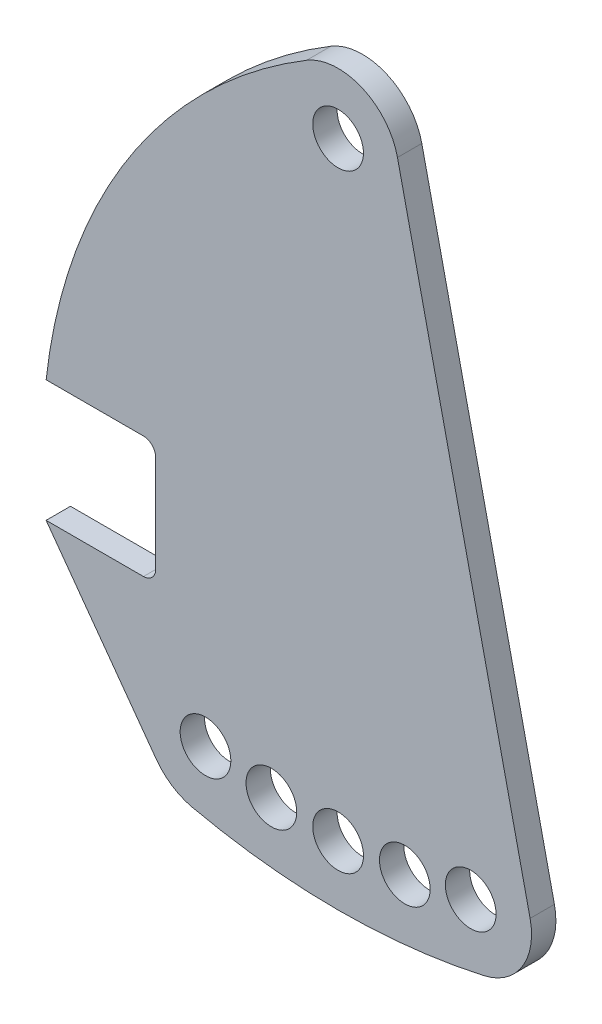
ISO-10303-21;
HEADER;
FILE_DESCRIPTION(('STEP AP214'),'2;1');
FILE_NAME('part.step','',(''),(''),'','','');
FILE_SCHEMA(('AUTOMOTIVE_DESIGN { 1 0 10303 214 1 1 1 1 }'));
ENDSEC;
DATA;
#1=APPLICATION_CONTEXT('core data for automotive mechanical design processes');
#2=APPLICATION_PROTOCOL_DEFINITION('international standard','automotive_design',2000,#1);
#3=PRODUCT_CONTEXT('',#1,'mechanical');
#4=PRODUCT('Part','Part','',(#3));
#5=PRODUCT_RELATED_PRODUCT_CATEGORY('part','',(#4));
#6=PRODUCT_DEFINITION_FORMATION('','',#4);
#7=PRODUCT_DEFINITION_CONTEXT('part definition',#1,'design');
#8=PRODUCT_DEFINITION('design','',#6,#7);
#9=PRODUCT_DEFINITION_SHAPE('','',#8);
#10=(LENGTH_UNIT() NAMED_UNIT(*) SI_UNIT(.MILLI.,.METRE.));
#11=(NAMED_UNIT(*) PLANE_ANGLE_UNIT() SI_UNIT($,.RADIAN.));
#12=(NAMED_UNIT(*) SI_UNIT($,.STERADIAN.) SOLID_ANGLE_UNIT());
#13=UNCERTAINTY_MEASURE_WITH_UNIT(LENGTH_MEASURE(1.E-05),#10,'distance_accuracy_value','');
#14=(GEOMETRIC_REPRESENTATION_CONTEXT(3) GLOBAL_UNCERTAINTY_ASSIGNED_CONTEXT((#13)) GLOBAL_UNIT_ASSIGNED_CONTEXT((#10,
#11,#12)) REPRESENTATION_CONTEXT('',''));
#15=CARTESIAN_POINT('',(0.,0.,0.));
#16=DIRECTION('',(0.,0.,1.));
#17=DIRECTION('',(1.,0.,0.));
#18=AXIS2_PLACEMENT_3D('',#15,#16,#17);
#19=CARTESIAN_POINT('',(27.2901991456274,-43.6081884559611,6.));
#20=DIRECTION('',(0.,0.,1.));
#21=DIRECTION('',(1.,0.,0.));
#22=AXIS2_PLACEMENT_3D('',#19,#20,#21);
#23=PLANE('',#22);
#24=CARTESIAN_POINT('',(76.4329181119862,-46.4218250983476,6.));
#25=DIRECTION('',(0.,0.,1.));
#26=DIRECTION('',(1.,0.,0.));
#27=AXIS2_PLACEMENT_3D('',#24,#25,#26);
#28=CIRCLE('',#27,6.25000000000003);
#29=CARTESIAN_POINT('',(82.6829181119862,-46.4218250983476,6.));
#30=VERTEX_POINT('',#29);
#31=EDGE_CURVE('E304',#30,#30,#28,.T.);
#32=ORIENTED_EDGE('',*,*,#31,.F.);
#33=EDGE_LOOP('',(#32));
#34=FACE_BOUND('',#33,.T.);
#35=CARTESIAN_POINT('',(43.5333777049843,-46.4218250983477,6.));
#36=DIRECTION('',(0.,0.,1.));
#37=DIRECTION('',(1.,0.,0.));
#38=AXIS2_PLACEMENT_3D('',#35,#36,#37);
#39=CIRCLE('',#38,6.25000000000003);
#40=CARTESIAN_POINT('',(49.7833777049844,-46.4218250983477,6.));
#41=VERTEX_POINT('',#40);
#42=EDGE_CURVE('E316',#41,#41,#39,.T.);
#43=ORIENTED_EDGE('',*,*,#42,.F.);
#44=EDGE_LOOP('',(#43));
#45=FACE_BOUND('',#44,.T.);
#46=CARTESIAN_POINT('',(59.9831479084851,102.5,6.));
#47=DIRECTION('',(0.,0.,1.));
#48=DIRECTION('',(1.,0.,0.));
#49=AXIS2_PLACEMENT_3D('',#46,#47,#48);
#50=CIRCLE('',#49,6.24999999999997);
#51=CARTESIAN_POINT('',(66.2331479084851,102.5,6.));
#52=VERTEX_POINT('',#51);
#53=EDGE_CURVE('E163',#52,#52,#50,.T.);
#54=ORIENTED_EDGE('',*,*,#53,.F.);
#55=EDGE_LOOP('',(#54));
#56=FACE_BOUND('',#55,.T.);
#57=DIRECTION('',(0.587277117656198,-0.809385932097555,0.));
#58=VECTOR('',#57,1.);
#59=CARTESIAN_POINT('',(-12.,-15.,6.));
#60=LINE('',#59,#58);
#61=CARTESIAN_POINT('',(-12.,-15.,6.));
#62=VERTEX_POINT('',#61);
#63=CARTESIAN_POINT('',(15.1494101641639,-52.4173452208039,6.));
#64=VERTEX_POINT('',#63);
#65=EDGE_CURVE('E182',#62,#64,#60,.T.);
#66=ORIENTED_EDGE('',*,*,#65,.T.);
#67=CARTESIAN_POINT('',(27.2901991456274,-43.6081884559611,6.));
#68=DIRECTION('',(0.,0.,1.));
#69=DIRECTION('',(1.,0.,0.));
#70=AXIS2_PLACEMENT_3D('',#67,#68,#69);
#71=CIRCLE('',#70,15.);
#72=CARTESIAN_POINT('',(24.0148159792438,-58.2462165032552,6.));
#73=VERTEX_POINT('',#72);
#74=EDGE_CURVE('E110',#64,#73,#71,.T.);
#75=ORIENTED_EDGE('',*,*,#74,.T.);
#76=CARTESIAN_POINT('',(59.9831479084854,102.5,6.));
#77=DIRECTION('',(0.,0.,1.));
#78=DIRECTION('',(1.,0.,0.));
#79=AXIS2_PLACEMENT_3D('',#76,#77,#78);
#80=CIRCLE('',#79,164.721179639667);
#81=CARTESIAN_POINT('',(95.951479837727,-58.2462165032552,6.));
#82=VERTEX_POINT('',#81);
#83=EDGE_CURVE('E209',#73,#82,#80,.T.);
#84=ORIENTED_EDGE('',*,*,#83,.T.);
#85=CARTESIAN_POINT('',(92.6760966713434,-43.608188455961,6.));
#86=DIRECTION('',(0.,0.,1.));
#87=DIRECTION('',(1.,0.,0.));
#88=AXIS2_PLACEMENT_3D('',#85,#86,#87);
#89=CIRCLE('',#88,15.);
#90=CARTESIAN_POINT('',(107.314124718638,-40.3328052895773,6.));
#91=VERTEX_POINT('',#90);
#92=EDGE_CURVE('E228',#82,#91,#89,.T.);
#93=ORIENTED_EDGE('',*,*,#92,.T.);
#94=DIRECTION('',(-0.21835887775891,0.975868536486277,0.));
#95=VECTOR('',#94,1.);
#96=CARTESIAN_POINT('',(74.6211759557796,105.775383166384,6.));
#97=LINE('',#96,#95);
#98=CARTESIAN_POINT('',(74.6211759557796,105.775383166384,6.));
#99=VERTEX_POINT('',#98);
#100=EDGE_CURVE('E225',#91,#99,#97,.T.);
#101=ORIENTED_EDGE('',*,*,#100,.T.);
#102=CARTESIAN_POINT('',(59.9831479084851,102.5,6.));
#103=DIRECTION('',(0.,0.,1.));
#104=DIRECTION('',(1.,0.,0.));
#105=AXIS2_PLACEMENT_3D('',#102,#103,#104);
#106=CIRCLE('',#105,15.0000000000004);
#107=CARTESIAN_POINT('',(52.2250505650219,115.337909705608,6.));
#108=VERTEX_POINT('',#107);
#109=EDGE_CURVE('E227',#99,#108,#106,.T.);
#110=ORIENTED_EDGE('',*,*,#109,.T.);
#111=CARTESIAN_POINT('',(121.925083623893,0.,6.));
#112=DIRECTION('',(0.,0.,1.));
#113=DIRECTION('',(1.,0.,0.));
#114=AXIS2_PLACEMENT_3D('',#111,#112,#113);
#115=CIRCLE('',#114,134.762487449835);
#116=CARTESIAN_POINT('',(-12.0000000000002,15.,6.));
#117=VERTEX_POINT('',#116);
#118=EDGE_CURVE('E230',#108,#117,#115,.T.);
#119=ORIENTED_EDGE('',*,*,#118,.T.);
#120=DIRECTION('',(1.,0.,0.));
#121=VECTOR('',#120,1.);
#122=CARTESIAN_POINT('',(-12.0000000000002,15.,6.));
#123=LINE('',#122,#121);
#124=CARTESIAN_POINT('',(12.,15.,6.));
#125=VERTEX_POINT('',#124);
#126=EDGE_CURVE('E236',#117,#125,#123,.T.);
#127=ORIENTED_EDGE('',*,*,#126,.T.);
#128=CARTESIAN_POINT('',(12.,12.,6.));
#129=DIRECTION('',(0.,0.,-1.));
#130=DIRECTION('',(1.,0.,0.));
#131=AXIS2_PLACEMENT_3D('',#128,#129,#130);
#132=CIRCLE('',#131,2.99999999999999);
#133=CARTESIAN_POINT('',(15.,12.,6.));
#134=VERTEX_POINT('',#133);
#135=EDGE_CURVE('E141',#125,#134,#132,.T.);
#136=ORIENTED_EDGE('',*,*,#135,.T.);
#137=DIRECTION('',(0.,-1.,0.));
#138=VECTOR('',#137,1.);
#139=CARTESIAN_POINT('',(15.,12.,6.));
#140=LINE('',#139,#138);
#141=CARTESIAN_POINT('',(15.,-12.,6.));
#142=VERTEX_POINT('',#141);
#143=EDGE_CURVE('E135',#134,#142,#140,.T.);
#144=ORIENTED_EDGE('',*,*,#143,.T.);
#145=CARTESIAN_POINT('',(12.,-12.,6.));
#146=DIRECTION('',(0.,0.,-1.));
#147=DIRECTION('',(1.,0.,0.));
#148=AXIS2_PLACEMENT_3D('',#145,#146,#147);
#149=CIRCLE('',#148,3.);
#150=CARTESIAN_POINT('',(12.,-15.,6.));
#151=VERTEX_POINT('',#150);
#152=EDGE_CURVE('E139',#142,#151,#149,.T.);
#153=ORIENTED_EDGE('',*,*,#152,.T.);
#154=DIRECTION('',(-1.,0.,0.));
#155=VECTOR('',#154,1.);
#156=CARTESIAN_POINT('',(-12.,-15.,6.));
#157=LINE('',#156,#155);
#158=EDGE_CURVE('E55',#151,#62,#157,.T.);
#159=ORIENTED_EDGE('',*,*,#158,.T.);
#160=EDGE_LOOP('',(#66,#75,#84,#93,#101,#110,#119,#127,#136,#144,#153,#159));
#161=FACE_BOUND('',#160,.T.);
#162=CARTESIAN_POINT('',(27.2901991456274,-43.6081884559611,6.));
#163=DIRECTION('',(0.,0.,1.));
#164=DIRECTION('',(1.,0.,0.));
#165=AXIS2_PLACEMENT_3D('',#162,#163,#164);
#166=CIRCLE('',#165,6.25000000000003);
#167=CARTESIAN_POINT('',(33.5401991456274,-43.6081884559611,6.));
#168=VERTEX_POINT('',#167);
#169=EDGE_CURVE('E322',#168,#168,#166,.T.);
#170=ORIENTED_EDGE('',*,*,#169,.F.);
#171=EDGE_LOOP('',(#170));
#172=FACE_BOUND('',#171,.T.);
#173=CARTESIAN_POINT('',(59.9831479084851,-47.5000000000001,6.));
#174=DIRECTION('',(0.,0.,1.));
#175=DIRECTION('',(1.,0.,0.));
#176=AXIS2_PLACEMENT_3D('',#173,#174,#175);
#177=CIRCLE('',#176,6.25000000000003);
#178=CARTESIAN_POINT('',(66.2331479084851,-47.5000000000001,6.));
#179=VERTEX_POINT('',#178);
#180=EDGE_CURVE('E310',#179,#179,#177,.T.);
#181=ORIENTED_EDGE('',*,*,#180,.F.);
#182=EDGE_LOOP('',(#181));
#183=FACE_BOUND('',#182,.T.);
#184=CARTESIAN_POINT('',(92.6760966713434,-43.608188455961,6.));
#185=DIRECTION('',(0.,0.,1.));
#186=DIRECTION('',(1.,0.,0.));
#187=AXIS2_PLACEMENT_3D('',#184,#185,#186);
#188=CIRCLE('',#187,6.25000000000009);
#189=CARTESIAN_POINT('',(98.9260966713434,-43.608188455961,6.));
#190=VERTEX_POINT('',#189);
#191=EDGE_CURVE('E295',#190,#190,#188,.T.);
#192=ORIENTED_EDGE('',*,*,#191,.F.);
#193=EDGE_LOOP('',(#192));
#194=FACE_BOUND('',#193,.T.);
#195=ADVANCED_FACE('F38',(#34,#45,#56,#161,#172,#183,#194),#23,.T.);
#196=CARTESIAN_POINT('',(27.2901991456274,-43.6081884559611,0.));
#197=DIRECTION('',(0.,0.,1.));
#198=DIRECTION('',(1.,0.,0.));
#199=AXIS2_PLACEMENT_3D('',#196,#197,#198);
#200=PLANE('',#199);
#201=DIRECTION('',(0.587277117656198,-0.809385932097555,0.));
#202=VECTOR('',#201,1.);
#203=CARTESIAN_POINT('',(-12.,-15.,0.));
#204=LINE('',#203,#202);
#205=CARTESIAN_POINT('',(-12.,-15.,0.));
#206=VERTEX_POINT('',#205);
#207=CARTESIAN_POINT('',(15.1494101641639,-52.4173452208039,0.));
#208=VERTEX_POINT('',#207);
#209=EDGE_CURVE('E159',#206,#208,#204,.T.);
#210=ORIENTED_EDGE('',*,*,#209,.F.);
#211=DIRECTION('',(-1.,0.,0.));
#212=VECTOR('',#211,1.);
#213=CARTESIAN_POINT('',(-12.,-15.,0.));
#214=LINE('',#213,#212);
#215=CARTESIAN_POINT('',(12.,-15.,0.));
#216=VERTEX_POINT('',#215);
#217=EDGE_CURVE('E102',#216,#206,#214,.T.);
#218=ORIENTED_EDGE('',*,*,#217,.F.);
#219=CARTESIAN_POINT('',(12.,-12.,0.));
#220=DIRECTION('',(0.,0.,-1.));
#221=DIRECTION('',(1.,0.,0.));
#222=AXIS2_PLACEMENT_3D('',#219,#220,#221);
#223=CIRCLE('',#222,3.);
#224=CARTESIAN_POINT('',(15.,-12.,0.));
#225=VERTEX_POINT('',#224);
#226=EDGE_CURVE('E96',#225,#216,#223,.T.);
#227=ORIENTED_EDGE('',*,*,#226,.F.);
#228=DIRECTION('',(0.,-1.,0.));
#229=VECTOR('',#228,1.);
#230=CARTESIAN_POINT('',(15.,12.,0.));
#231=LINE('',#230,#229);
#232=CARTESIAN_POINT('',(15.,12.,0.));
#233=VERTEX_POINT('',#232);
#234=EDGE_CURVE('E149',#233,#225,#231,.T.);
#235=ORIENTED_EDGE('',*,*,#234,.F.);
#236=CARTESIAN_POINT('',(12.,12.,0.));
#237=DIRECTION('',(0.,0.,-1.));
#238=DIRECTION('',(1.,0.,0.));
#239=AXIS2_PLACEMENT_3D('',#236,#237,#238);
#240=CIRCLE('',#239,2.99999999999999);
#241=CARTESIAN_POINT('',(12.,15.,0.));
#242=VERTEX_POINT('',#241);
#243=EDGE_CURVE('E177',#242,#233,#240,.T.);
#244=ORIENTED_EDGE('',*,*,#243,.F.);
#245=DIRECTION('',(1.,0.,0.));
#246=VECTOR('',#245,1.);
#247=CARTESIAN_POINT('',(-12.0000000000002,15.,0.));
#248=LINE('',#247,#246);
#249=CARTESIAN_POINT('',(-12.0000000000002,15.,0.));
#250=VERTEX_POINT('',#249);
#251=EDGE_CURVE('E175',#250,#242,#248,.T.);
#252=ORIENTED_EDGE('',*,*,#251,.F.);
#253=CARTESIAN_POINT('',(121.925083623893,0.,0.));
#254=DIRECTION('',(0.,0.,1.));
#255=DIRECTION('',(1.,0.,0.));
#256=AXIS2_PLACEMENT_3D('',#253,#254,#255);
#257=CIRCLE('',#256,134.762487449835);
#258=CARTESIAN_POINT('',(52.2250505650219,115.337909705608,0.));
#259=VERTEX_POINT('',#258);
#260=EDGE_CURVE('E173',#259,#250,#257,.T.);
#261=ORIENTED_EDGE('',*,*,#260,.F.);
#262=CARTESIAN_POINT('',(59.9831479084851,102.5,0.));
#263=DIRECTION('',(0.,0.,1.));
#264=DIRECTION('',(1.,0.,0.));
#265=AXIS2_PLACEMENT_3D('',#262,#263,#264);
#266=CIRCLE('',#265,15.0000000000004);
#267=CARTESIAN_POINT('',(74.6211759557796,105.775383166384,0.));
#268=VERTEX_POINT('',#267);
#269=EDGE_CURVE('E171',#268,#259,#266,.T.);
#270=ORIENTED_EDGE('',*,*,#269,.F.);
#271=DIRECTION('',(-0.21835887775891,0.975868536486277,0.));
#272=VECTOR('',#271,1.);
#273=CARTESIAN_POINT('',(74.6211759557796,105.775383166384,0.));
#274=LINE('',#273,#272);
#275=CARTESIAN_POINT('',(107.314124718638,-40.3328052895773,0.));
#276=VERTEX_POINT('',#275);
#277=EDGE_CURVE('E169',#276,#268,#274,.T.);
#278=ORIENTED_EDGE('',*,*,#277,.F.);
#279=CARTESIAN_POINT('',(92.6760966713434,-43.608188455961,0.));
#280=DIRECTION('',(0.,0.,1.));
#281=DIRECTION('',(1.,0.,0.));
#282=AXIS2_PLACEMENT_3D('',#279,#280,#281);
#283=CIRCLE('',#282,15.);
#284=CARTESIAN_POINT('',(95.951479837727,-58.2462165032552,0.));
#285=VERTEX_POINT('',#284);
#286=EDGE_CURVE('E167',#285,#276,#283,.T.);
#287=ORIENTED_EDGE('',*,*,#286,.F.);
#288=CARTESIAN_POINT('',(59.9831479084854,102.5,0.));
#289=DIRECTION('',(0.,0.,1.));
#290=DIRECTION('',(1.,0.,0.));
#291=AXIS2_PLACEMENT_3D('',#288,#289,#290);
#292=CIRCLE('',#291,164.721179639667);
#293=CARTESIAN_POINT('',(24.0148159792438,-58.2462165032552,0.));
#294=VERTEX_POINT('',#293);
#295=EDGE_CURVE('E165',#294,#285,#292,.T.);
#296=ORIENTED_EDGE('',*,*,#295,.F.);
#297=CARTESIAN_POINT('',(27.2901991456274,-43.6081884559611,0.));
#298=DIRECTION('',(0.,0.,1.));
#299=DIRECTION('',(1.,0.,0.));
#300=AXIS2_PLACEMENT_3D('',#297,#298,#299);
#301=CIRCLE('',#300,15.);
#302=EDGE_CURVE('E162',#208,#294,#301,.T.);
#303=ORIENTED_EDGE('',*,*,#302,.F.);
#304=EDGE_LOOP('',(#210,#218,#227,#235,#244,#252,#261,#270,#278,#287,#296,#303));
#305=FACE_BOUND('',#304,.T.);
#306=CARTESIAN_POINT('',(59.9831479084851,102.5,0.));
#307=DIRECTION('',(0.,0.,1.));
#308=DIRECTION('',(1.,0.,0.));
#309=AXIS2_PLACEMENT_3D('',#306,#307,#308);
#310=CIRCLE('',#309,6.24999999999997);
#311=CARTESIAN_POINT('',(66.2331479084851,102.5,0.));
#312=VERTEX_POINT('',#311);
#313=EDGE_CURVE('E325',#312,#312,#310,.T.);
#314=ORIENTED_EDGE('',*,*,#313,.T.);
#315=EDGE_LOOP('',(#314));
#316=FACE_BOUND('',#315,.T.);
#317=CARTESIAN_POINT('',(27.2901991456274,-43.6081884559611,0.));
#318=DIRECTION('',(0.,0.,1.));
#319=DIRECTION('',(1.,0.,0.));
#320=AXIS2_PLACEMENT_3D('',#317,#318,#319);
#321=CIRCLE('',#320,6.25000000000003);
#322=CARTESIAN_POINT('',(33.5401991456274,-43.6081884559611,0.));
#323=VERTEX_POINT('',#322);
#324=EDGE_CURVE('E319',#323,#323,#321,.T.);
#325=ORIENTED_EDGE('',*,*,#324,.T.);
#326=EDGE_LOOP('',(#325));
#327=FACE_BOUND('',#326,.T.);
#328=CARTESIAN_POINT('',(43.5333777049843,-46.4218250983477,0.));
#329=DIRECTION('',(0.,0.,1.));
#330=DIRECTION('',(1.,0.,0.));
#331=AXIS2_PLACEMENT_3D('',#328,#329,#330);
#332=CIRCLE('',#331,6.25000000000003);
#333=CARTESIAN_POINT('',(49.7833777049844,-46.4218250983477,0.));
#334=VERTEX_POINT('',#333);
#335=EDGE_CURVE('E313',#334,#334,#332,.T.);
#336=ORIENTED_EDGE('',*,*,#335,.T.);
#337=EDGE_LOOP('',(#336));
#338=FACE_BOUND('',#337,.T.);
#339=CARTESIAN_POINT('',(59.9831479084851,-47.5000000000001,0.));
#340=DIRECTION('',(0.,0.,1.));
#341=DIRECTION('',(1.,0.,0.));
#342=AXIS2_PLACEMENT_3D('',#339,#340,#341);
#343=CIRCLE('',#342,6.25000000000003);
#344=CARTESIAN_POINT('',(66.2331479084851,-47.5000000000001,0.));
#345=VERTEX_POINT('',#344);
#346=EDGE_CURVE('E307',#345,#345,#343,.T.);
#347=ORIENTED_EDGE('',*,*,#346,.T.);
#348=EDGE_LOOP('',(#347));
#349=FACE_BOUND('',#348,.T.);
#350=CARTESIAN_POINT('',(76.4329181119862,-46.4218250983476,0.));
#351=DIRECTION('',(0.,0.,1.));
#352=DIRECTION('',(1.,0.,0.));
#353=AXIS2_PLACEMENT_3D('',#350,#351,#352);
#354=CIRCLE('',#353,6.25000000000003);
#355=CARTESIAN_POINT('',(82.6829181119862,-46.4218250983476,0.));
#356=VERTEX_POINT('',#355);
#357=EDGE_CURVE('E301',#356,#356,#354,.T.);
#358=ORIENTED_EDGE('',*,*,#357,.T.);
#359=EDGE_LOOP('',(#358));
#360=FACE_BOUND('',#359,.T.);
#361=CARTESIAN_POINT('',(92.6760966713434,-43.608188455961,0.));
#362=DIRECTION('',(0.,0.,1.));
#363=DIRECTION('',(1.,0.,0.));
#364=AXIS2_PLACEMENT_3D('',#361,#362,#363);
#365=CIRCLE('',#364,6.25000000000009);
#366=CARTESIAN_POINT('',(98.9260966713434,-43.608188455961,0.));
#367=VERTEX_POINT('',#366);
#368=EDGE_CURVE('E298',#367,#367,#365,.T.);
#369=ORIENTED_EDGE('',*,*,#368,.T.);
#370=EDGE_LOOP('',(#369));
#371=FACE_BOUND('',#370,.T.);
#372=ADVANCED_FACE('F213',(#305,#316,#327,#338,#349,#360,#371),#200,.F.);
#373=CARTESIAN_POINT('',(-12.,-15.,6.));
#374=DIRECTION('',(0.809385932097555,0.587277117656198,0.));
#375=DIRECTION('',(-0.587277117656198,0.809385932097555,0.));
#376=AXIS2_PLACEMENT_3D('',#373,#374,#375);
#377=PLANE('',#376);
#378=ORIENTED_EDGE('',*,*,#209,.T.);
#379=DIRECTION('',(0.,0.,-1.));
#380=VECTOR('',#379,1.);
#381=CARTESIAN_POINT('',(15.1494101641639,-52.4173452208039,6.));
#382=LINE('',#381,#380);
#383=EDGE_CURVE('E11',#64,#208,#382,.T.);
#384=ORIENTED_EDGE('',*,*,#383,.F.);
#385=ORIENTED_EDGE('',*,*,#65,.F.);
#386=DIRECTION('',(0.,0.,-1.));
#387=VECTOR('',#386,1.);
#388=CARTESIAN_POINT('',(-12.,-15.,6.));
#389=LINE('',#388,#387);
#390=EDGE_CURVE('E155',#62,#206,#389,.T.);
#391=ORIENTED_EDGE('',*,*,#390,.T.);
#392=EDGE_LOOP('',(#378,#384,#385,#391));
#393=FACE_BOUND('',#392,.T.);
#394=ADVANCED_FACE('F40',(#393),#377,.F.);
#395=CARTESIAN_POINT('',(27.2901991456274,-43.6081884559611,6.));
#396=DIRECTION('',(0.,0.,-1.));
#397=DIRECTION('',(-1.,0.,0.));
#398=AXIS2_PLACEMENT_3D('',#395,#396,#397);
#399=CYLINDRICAL_SURFACE('',#398,15.);
#400=ORIENTED_EDGE('',*,*,#302,.T.);
#401=DIRECTION('',(0.,0.,-1.));
#402=VECTOR('',#401,1.);
#403=CARTESIAN_POINT('',(24.0148159792438,-58.2462165032552,6.));
#404=LINE('',#403,#402);
#405=EDGE_CURVE('E47',#73,#294,#404,.T.);
#406=ORIENTED_EDGE('',*,*,#405,.F.);
#407=ORIENTED_EDGE('',*,*,#74,.F.);
#408=ORIENTED_EDGE('',*,*,#383,.T.);
#409=EDGE_LOOP('',(#400,#406,#407,#408));
#410=FACE_BOUND('',#409,.T.);
#411=ADVANCED_FACE('F463',(#410),#399,.T.);
#412=CARTESIAN_POINT('',(59.9831479084854,102.5,6.));
#413=DIRECTION('',(0.,0.,-1.));
#414=DIRECTION('',(-1.,0.,0.));
#415=AXIS2_PLACEMENT_3D('',#412,#413,#414);
#416=CYLINDRICAL_SURFACE('',#415,164.721179639667);
#417=ORIENTED_EDGE('',*,*,#295,.T.);
#418=DIRECTION('',(0.,0.,-1.));
#419=VECTOR('',#418,1.);
#420=CARTESIAN_POINT('',(95.951479837727,-58.2462165032552,6.));
#421=LINE('',#420,#419);
#422=EDGE_CURVE('E201',#82,#285,#421,.T.);
#423=ORIENTED_EDGE('',*,*,#422,.F.);
#424=ORIENTED_EDGE('',*,*,#83,.F.);
#425=ORIENTED_EDGE('',*,*,#405,.T.);
#426=EDGE_LOOP('',(#417,#423,#424,#425));
#427=FACE_BOUND('',#426,.T.);
#428=ADVANCED_FACE('F207',(#427),#416,.T.);
#429=CARTESIAN_POINT('',(92.6760966713434,-43.608188455961,6.));
#430=DIRECTION('',(0.,0.,-1.));
#431=DIRECTION('',(-1.,0.,0.));
#432=AXIS2_PLACEMENT_3D('',#429,#430,#431);
#433=CYLINDRICAL_SURFACE('',#432,15.);
#434=ORIENTED_EDGE('',*,*,#286,.T.);
#435=DIRECTION('',(0.,0.,-1.));
#436=VECTOR('',#435,1.);
#437=CARTESIAN_POINT('',(107.314124718638,-40.3328052895773,6.));
#438=LINE('',#437,#436);
#439=EDGE_CURVE('E198',#91,#276,#438,.T.);
#440=ORIENTED_EDGE('',*,*,#439,.F.);
#441=ORIENTED_EDGE('',*,*,#92,.F.);
#442=ORIENTED_EDGE('',*,*,#422,.T.);
#443=EDGE_LOOP('',(#434,#440,#441,#442));
#444=FACE_BOUND('',#443,.T.);
#445=ADVANCED_FACE('F219',(#444),#433,.T.);
#446=CARTESIAN_POINT('',(74.6211759557796,105.775383166384,6.));
#447=DIRECTION('',(-0.975868536486277,-0.21835887775891,0.));
#448=DIRECTION('',(0.21835887775891,-0.975868536486278,0.));
#449=AXIS2_PLACEMENT_3D('',#446,#447,#448);
#450=PLANE('',#449);
#451=ORIENTED_EDGE('',*,*,#277,.T.);
#452=DIRECTION('',(0.,0.,-1.));
#453=VECTOR('',#452,1.);
#454=CARTESIAN_POINT('',(74.6211759557796,105.775383166384,6.));
#455=LINE('',#454,#453);
#456=EDGE_CURVE('E195',#99,#268,#455,.T.);
#457=ORIENTED_EDGE('',*,*,#456,.F.);
#458=ORIENTED_EDGE('',*,*,#100,.F.);
#459=ORIENTED_EDGE('',*,*,#439,.T.);
#460=EDGE_LOOP('',(#451,#457,#458,#459));
#461=FACE_BOUND('',#460,.T.);
#462=ADVANCED_FACE('F223',(#461),#450,.F.);
#463=CARTESIAN_POINT('',(59.9831479084851,102.5,6.));
#464=DIRECTION('',(0.,0.,-1.));
#465=DIRECTION('',(-1.,0.,0.));
#466=AXIS2_PLACEMENT_3D('',#463,#464,#465);
#467=CYLINDRICAL_SURFACE('',#466,15.0000000000004);
#468=ORIENTED_EDGE('',*,*,#269,.T.);
#469=DIRECTION('',(0.,0.,-1.));
#470=VECTOR('',#469,1.);
#471=CARTESIAN_POINT('',(52.2250505650219,115.337909705608,6.));
#472=LINE('',#471,#470);
#473=EDGE_CURVE('E192',#108,#259,#472,.T.);
#474=ORIENTED_EDGE('',*,*,#473,.F.);
#475=ORIENTED_EDGE('',*,*,#109,.F.);
#476=ORIENTED_EDGE('',*,*,#456,.T.);
#477=EDGE_LOOP('',(#468,#474,#475,#476));
#478=FACE_BOUND('',#477,.T.);
#479=ADVANCED_FACE('F424',(#478),#467,.T.);
#480=CARTESIAN_POINT('',(121.925083623893,0.,6.));
#481=DIRECTION('',(0.,0.,-1.));
#482=DIRECTION('',(-1.,0.,0.));
#483=AXIS2_PLACEMENT_3D('',#480,#481,#482);
#484=CYLINDRICAL_SURFACE('',#483,134.762487449835);
#485=ORIENTED_EDGE('',*,*,#260,.T.);
#486=DIRECTION('',(0.,0.,-1.));
#487=VECTOR('',#486,1.);
#488=CARTESIAN_POINT('',(-12.0000000000002,15.,6.));
#489=LINE('',#488,#487);
#490=EDGE_CURVE('E189',#117,#250,#489,.T.);
#491=ORIENTED_EDGE('',*,*,#490,.F.);
#492=ORIENTED_EDGE('',*,*,#118,.F.);
#493=ORIENTED_EDGE('',*,*,#473,.T.);
#494=EDGE_LOOP('',(#485,#491,#492,#493));
#495=FACE_BOUND('',#494,.T.);
#496=ADVANCED_FACE('F414',(#495),#484,.T.);
#497=CARTESIAN_POINT('',(-12.0000000000002,15.,6.));
#498=DIRECTION('',(0.,1.,0.));
#499=DIRECTION('',(-1.,0.,0.));
#500=AXIS2_PLACEMENT_3D('',#497,#498,#499);
#501=PLANE('',#500);
#502=ORIENTED_EDGE('',*,*,#251,.T.);
#503=DIRECTION('',(0.,0.,-1.));
#504=VECTOR('',#503,1.);
#505=CARTESIAN_POINT('',(12.,15.,6.));
#506=LINE('',#505,#504);
#507=EDGE_CURVE('E186',#125,#242,#506,.T.);
#508=ORIENTED_EDGE('',*,*,#507,.F.);
#509=ORIENTED_EDGE('',*,*,#126,.F.);
#510=ORIENTED_EDGE('',*,*,#490,.T.);
#511=EDGE_LOOP('',(#502,#508,#509,#510));
#512=FACE_BOUND('',#511,.T.);
#513=ADVANCED_FACE('F242',(#512),#501,.F.);
#514=CARTESIAN_POINT('',(12.,12.,6.));
#515=DIRECTION('',(0.,0.,-1.));
#516=DIRECTION('',(-1.,0.,0.));
#517=AXIS2_PLACEMENT_3D('',#514,#515,#516);
#518=CYLINDRICAL_SURFACE('',#517,2.99999999999999);
#519=ORIENTED_EDGE('',*,*,#243,.T.);
#520=DIRECTION('',(0.,0.,-1.));
#521=VECTOR('',#520,1.);
#522=CARTESIAN_POINT('',(15.,12.,6.));
#523=LINE('',#522,#521);
#524=EDGE_CURVE('E150',#134,#233,#523,.T.);
#525=ORIENTED_EDGE('',*,*,#524,.F.);
#526=ORIENTED_EDGE('',*,*,#135,.F.);
#527=ORIENTED_EDGE('',*,*,#507,.T.);
#528=EDGE_LOOP('',(#519,#525,#526,#527));
#529=FACE_BOUND('',#528,.T.);
#530=ADVANCED_FACE('F246',(#529),#518,.F.);
#531=CARTESIAN_POINT('',(15.,12.,6.));
#532=DIRECTION('',(1.,0.,0.));
#533=DIRECTION('',(0.,0.,-1.));
#534=AXIS2_PLACEMENT_3D('',#531,#532,#533);
#535=PLANE('',#534);
#536=ORIENTED_EDGE('',*,*,#234,.T.);
#537=DIRECTION('',(0.,0.,-1.));
#538=VECTOR('',#537,1.);
#539=CARTESIAN_POINT('',(15.,-12.,6.));
#540=LINE('',#539,#538);
#541=EDGE_CURVE('E146',#142,#225,#540,.T.);
#542=ORIENTED_EDGE('',*,*,#541,.F.);
#543=ORIENTED_EDGE('',*,*,#143,.F.);
#544=ORIENTED_EDGE('',*,*,#524,.T.);
#545=EDGE_LOOP('',(#536,#542,#543,#544));
#546=FACE_BOUND('',#545,.T.);
#547=ADVANCED_FACE('F147',(#546),#535,.F.);
#548=CARTESIAN_POINT('',(12.,-12.,6.));
#549=DIRECTION('',(0.,0.,-1.));
#550=DIRECTION('',(-1.,0.,0.));
#551=AXIS2_PLACEMENT_3D('',#548,#549,#550);
#552=CYLINDRICAL_SURFACE('',#551,3.);
#553=ORIENTED_EDGE('',*,*,#226,.T.);
#554=DIRECTION('',(0.,0.,-1.));
#555=VECTOR('',#554,1.);
#556=CARTESIAN_POINT('',(12.,-15.,6.));
#557=LINE('',#556,#555);
#558=EDGE_CURVE('E151',#151,#216,#557,.T.);
#559=ORIENTED_EDGE('',*,*,#558,.F.);
#560=ORIENTED_EDGE('',*,*,#152,.F.);
#561=ORIENTED_EDGE('',*,*,#541,.T.);
#562=EDGE_LOOP('',(#553,#559,#560,#561));
#563=FACE_BOUND('',#562,.T.);
#564=ADVANCED_FACE('F153',(#563),#552,.F.);
#565=CARTESIAN_POINT('',(-12.,-15.,6.));
#566=DIRECTION('',(0.,-1.,0.));
#567=DIRECTION('',(1.,0.,0.));
#568=AXIS2_PLACEMENT_3D('',#565,#566,#567);
#569=PLANE('',#568);
#570=ORIENTED_EDGE('',*,*,#217,.T.);
#571=ORIENTED_EDGE('',*,*,#390,.F.);
#572=ORIENTED_EDGE('',*,*,#158,.F.);
#573=ORIENTED_EDGE('',*,*,#558,.T.);
#574=EDGE_LOOP('',(#570,#571,#572,#573));
#575=FACE_BOUND('',#574,.T.);
#576=ADVANCED_FACE('F250',(#575),#569,.F.);
#577=CARTESIAN_POINT('',(59.9831479084851,102.5,6.));
#578=DIRECTION('',(0.,0.,-1.));
#579=DIRECTION('',(-1.,0.,0.));
#580=AXIS2_PLACEMENT_3D('',#577,#578,#579);
#581=CYLINDRICAL_SURFACE('',#580,6.24999999999997);
#582=ORIENTED_EDGE('',*,*,#53,.T.);
#583=EDGE_LOOP('',(#582));
#584=FACE_BOUND('',#583,.T.);
#585=ORIENTED_EDGE('',*,*,#313,.F.);
#586=EDGE_LOOP('',(#585));
#587=FACE_BOUND('',#586,.T.);
#588=ADVANCED_FACE('F252',(#584,#587),#581,.F.);
#589=CARTESIAN_POINT('',(27.2901991456274,-43.6081884559611,6.));
#590=DIRECTION('',(0.,0.,-1.));
#591=DIRECTION('',(-1.,0.,0.));
#592=AXIS2_PLACEMENT_3D('',#589,#590,#591);
#593=CYLINDRICAL_SURFACE('',#592,6.25000000000003);
#594=ORIENTED_EDGE('',*,*,#169,.T.);
#595=EDGE_LOOP('',(#594));
#596=FACE_BOUND('',#595,.T.);
#597=ORIENTED_EDGE('',*,*,#324,.F.);
#598=EDGE_LOOP('',(#597));
#599=FACE_BOUND('',#598,.T.);
#600=ADVANCED_FACE('F258',(#596,#599),#593,.F.);
#601=CARTESIAN_POINT('',(43.5333777049843,-46.4218250983477,6.));
#602=DIRECTION('',(0.,0.,-1.));
#603=DIRECTION('',(-1.,0.,0.));
#604=AXIS2_PLACEMENT_3D('',#601,#602,#603);
#605=CYLINDRICAL_SURFACE('',#604,6.25000000000003);
#606=ORIENTED_EDGE('',*,*,#42,.T.);
#607=EDGE_LOOP('',(#606));
#608=FACE_BOUND('',#607,.T.);
#609=ORIENTED_EDGE('',*,*,#335,.F.);
#610=EDGE_LOOP('',(#609));
#611=FACE_BOUND('',#610,.T.);
#612=ADVANCED_FACE('F274',(#608,#611),#605,.F.);
#613=CARTESIAN_POINT('',(59.9831479084851,-47.5000000000001,6.));
#614=DIRECTION('',(0.,0.,-1.));
#615=DIRECTION('',(-1.,0.,0.));
#616=AXIS2_PLACEMENT_3D('',#613,#614,#615);
#617=CYLINDRICAL_SURFACE('',#616,6.25000000000003);
#618=ORIENTED_EDGE('',*,*,#180,.T.);
#619=EDGE_LOOP('',(#618));
#620=FACE_BOUND('',#619,.T.);
#621=ORIENTED_EDGE('',*,*,#346,.F.);
#622=EDGE_LOOP('',(#621));
#623=FACE_BOUND('',#622,.T.);
#624=ADVANCED_FACE('F278',(#620,#623),#617,.F.);
#625=CARTESIAN_POINT('',(76.4329181119862,-46.4218250983476,6.));
#626=DIRECTION('',(0.,0.,-1.));
#627=DIRECTION('',(-1.,0.,0.));
#628=AXIS2_PLACEMENT_3D('',#625,#626,#627);
#629=CYLINDRICAL_SURFACE('',#628,6.25000000000003);
#630=ORIENTED_EDGE('',*,*,#31,.T.);
#631=EDGE_LOOP('',(#630));
#632=FACE_BOUND('',#631,.T.);
#633=ORIENTED_EDGE('',*,*,#357,.F.);
#634=EDGE_LOOP('',(#633));
#635=FACE_BOUND('',#634,.T.);
#636=ADVANCED_FACE('F282',(#632,#635),#629,.F.);
#637=CARTESIAN_POINT('',(92.6760966713434,-43.608188455961,6.));
#638=DIRECTION('',(0.,0.,-1.));
#639=DIRECTION('',(-1.,0.,0.));
#640=AXIS2_PLACEMENT_3D('',#637,#638,#639);
#641=CYLINDRICAL_SURFACE('',#640,6.25000000000009);
#642=ORIENTED_EDGE('',*,*,#191,.T.);
#643=EDGE_LOOP('',(#642));
#644=FACE_BOUND('',#643,.T.);
#645=ORIENTED_EDGE('',*,*,#368,.F.);
#646=EDGE_LOOP('',(#645));
#647=FACE_BOUND('',#646,.T.);
#648=ADVANCED_FACE('F286',(#644,#647),#641,.F.);
#649=CLOSED_SHELL('',(#195,#372,#394,#411,#428,#445,#462,#479,#496,#513,#530,#547,#564,#576,
#588,#600,#612,#624,#636,#648));
#650=MANIFOLD_SOLID_BREP('B2',#649);
#651=ADVANCED_BREP_SHAPE_REPRESENTATION('',(#18,#650),#14);
#652=SHAPE_DEFINITION_REPRESENTATION(#9,#651);
ENDSEC;
END-ISO-10303-21;
